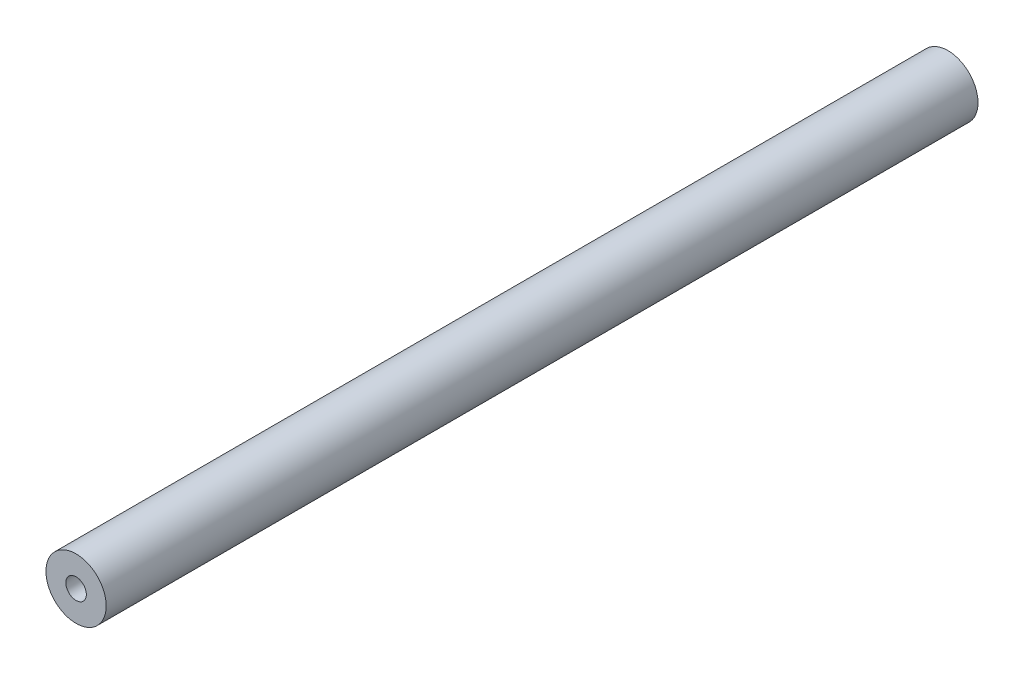
ISO-10303-21;
HEADER;
FILE_DESCRIPTION(('STEP AP214'),'2;1');
FILE_NAME('part.step','',(''),(''),'','','');
FILE_SCHEMA(('AUTOMOTIVE_DESIGN { 1 0 10303 214 1 1 1 1 }'));
ENDSEC;
DATA;
#1=APPLICATION_CONTEXT('core data for automotive mechanical design processes');
#2=APPLICATION_PROTOCOL_DEFINITION('international standard','automotive_design',2000,#1);
#3=PRODUCT_CONTEXT('',#1,'mechanical');
#4=PRODUCT('Part','Part','',(#3));
#5=PRODUCT_RELATED_PRODUCT_CATEGORY('part','',(#4));
#6=PRODUCT_DEFINITION_FORMATION('','',#4);
#7=PRODUCT_DEFINITION_CONTEXT('part definition',#1,'design');
#8=PRODUCT_DEFINITION('design','',#6,#7);
#9=PRODUCT_DEFINITION_SHAPE('','',#8);
#10=(LENGTH_UNIT() NAMED_UNIT(*) SI_UNIT(.MILLI.,.METRE.));
#11=(NAMED_UNIT(*) PLANE_ANGLE_UNIT() SI_UNIT($,.RADIAN.));
#12=(NAMED_UNIT(*) SI_UNIT($,.STERADIAN.) SOLID_ANGLE_UNIT());
#13=UNCERTAINTY_MEASURE_WITH_UNIT(LENGTH_MEASURE(1.E-05),#10,'distance_accuracy_value','');
#14=(GEOMETRIC_REPRESENTATION_CONTEXT(3) GLOBAL_UNCERTAINTY_ASSIGNED_CONTEXT((#13)) GLOBAL_UNIT_ASSIGNED_CONTEXT((#10,
#11,#12)) REPRESENTATION_CONTEXT('',''));
#15=CARTESIAN_POINT('',(0.,0.,0.));
#16=DIRECTION('',(0.,0.,1.));
#17=DIRECTION('',(1.,0.,0.));
#18=AXIS2_PLACEMENT_3D('',#15,#16,#17);
#19=CARTESIAN_POINT('',(0.,0.,217.));
#20=DIRECTION('',(0.,0.,-1.));
#21=DIRECTION('',(-1.,0.,0.));
#22=AXIS2_PLACEMENT_3D('',#19,#20,#21);
#23=CYLINDRICAL_SURFACE('',#22,15.);
#24=CARTESIAN_POINT('',(0.,0.,217.));
#25=DIRECTION('',(0.,0.,1.));
#26=DIRECTION('',(1.,0.,0.));
#27=AXIS2_PLACEMENT_3D('',#24,#25,#26);
#28=CIRCLE('',#27,15.);
#29=CARTESIAN_POINT('',(15.,0.,217.));
#30=VERTEX_POINT('',#29);
#31=EDGE_CURVE('E11',#30,#30,#28,.T.);
#32=ORIENTED_EDGE('',*,*,#31,.F.);
#33=EDGE_LOOP('',(#32));
#34=FACE_BOUND('',#33,.T.);
#35=CARTESIAN_POINT('',(0.,0.,-217.));
#36=DIRECTION('',(0.,0.,1.));
#37=DIRECTION('',(1.,0.,0.));
#38=AXIS2_PLACEMENT_3D('',#35,#36,#37);
#39=CIRCLE('',#38,15.);
#40=CARTESIAN_POINT('',(15.,0.,-217.));
#41=VERTEX_POINT('',#40);
#42=EDGE_CURVE('E43',#41,#41,#39,.T.);
#43=ORIENTED_EDGE('',*,*,#42,.T.);
#44=EDGE_LOOP('',(#43));
#45=FACE_BOUND('',#44,.T.);
#46=ADVANCED_FACE('F40',(#34,#45),#23,.T.);
#47=CARTESIAN_POINT('',(0.,0.,217.));
#48=DIRECTION('',(0.,0.,1.));
#49=DIRECTION('',(1.,0.,0.));
#50=AXIS2_PLACEMENT_3D('',#47,#48,#49);
#51=PLANE('',#50);
#52=CARTESIAN_POINT('',(0.,0.,217.));
#53=DIRECTION('',(0.,0.,1.));
#54=DIRECTION('',(1.,0.,0.));
#55=AXIS2_PLACEMENT_3D('',#52,#53,#54);
#56=CIRCLE('',#55,5.1);
#57=CARTESIAN_POINT('',(5.1,0.,217.));
#58=VERTEX_POINT('',#57);
#59=EDGE_CURVE('E64',#58,#58,#56,.T.);
#60=ORIENTED_EDGE('',*,*,#59,.F.);
#61=EDGE_LOOP('',(#60));
#62=FACE_BOUND('',#61,.T.);
#63=ORIENTED_EDGE('',*,*,#31,.T.);
#64=EDGE_LOOP('',(#63));
#65=FACE_BOUND('',#64,.T.);
#66=ADVANCED_FACE('F82',(#62,#65),#51,.T.);
#67=CARTESIAN_POINT('',(0.,0.,-217.));
#68=DIRECTION('',(0.,0.,1.));
#69=DIRECTION('',(1.,0.,0.));
#70=AXIS2_PLACEMENT_3D('',#67,#68,#69);
#71=PLANE('',#70);
#72=CARTESIAN_POINT('',(0.,0.,-217.));
#73=DIRECTION('',(0.,0.,-1.));
#74=DIRECTION('',(-1.,0.,0.));
#75=AXIS2_PLACEMENT_3D('',#72,#73,#74);
#76=CIRCLE('',#75,5.1);
#77=CARTESIAN_POINT('',(-5.1,0.,-217.));
#78=VERTEX_POINT('',#77);
#79=EDGE_CURVE('E63',#78,#78,#76,.T.);
#80=ORIENTED_EDGE('',*,*,#79,.F.);
#81=EDGE_LOOP('',(#80));
#82=FACE_BOUND('',#81,.T.);
#83=ORIENTED_EDGE('',*,*,#42,.F.);
#84=EDGE_LOOP('',(#83));
#85=FACE_BOUND('',#84,.T.);
#86=ADVANCED_FACE('F79',(#82,#85),#71,.F.);
#87=CARTESIAN_POINT('',(0.,0.,-187.75));
#88=DIRECTION('',(0.,0.,-1.));
#89=DIRECTION('',(-1.,0.,0.));
#90=AXIS2_PLACEMENT_3D('',#87,#88,#89);
#91=CONICAL_SURFACE('',#90,5.09999999999999,1.02974425867665);
#92=CARTESIAN_POINT('',(0.,0.,-184.685610842959));
#93=VERTEX_POINT('',#92);
#94=VERTEX_LOOP('',#93);
#95=FACE_BOUND('',#94,.T.);
#96=CARTESIAN_POINT('',(0.,0.,-187.75));
#97=DIRECTION('',(0.,0.,-1.));
#98=DIRECTION('',(-1.,0.,0.));
#99=AXIS2_PLACEMENT_3D('',#96,#97,#98);
#100=CIRCLE('',#99,5.09999999999999);
#101=CARTESIAN_POINT('',(-5.09999999999999,0.,-187.75));
#102=VERTEX_POINT('',#101);
#103=EDGE_CURVE('E67',#102,#102,#100,.T.);
#104=ORIENTED_EDGE('',*,*,#103,.T.);
#105=EDGE_LOOP('',(#104));
#106=FACE_BOUND('',#105,.T.);
#107=ADVANCED_FACE('F81',(#95,#106),#91,.F.);
#108=CARTESIAN_POINT('',(0.,0.,-217.));
#109=DIRECTION('',(0.,0.,-1.));
#110=DIRECTION('',(-1.,0.,0.));
#111=AXIS2_PLACEMENT_3D('',#108,#109,#110);
#112=CYLINDRICAL_SURFACE('',#111,5.1);
#113=ORIENTED_EDGE('',*,*,#103,.F.);
#114=EDGE_LOOP('',(#113));
#115=FACE_BOUND('',#114,.T.);
#116=ORIENTED_EDGE('',*,*,#79,.T.);
#117=EDGE_LOOP('',(#116));
#118=FACE_BOUND('',#117,.T.);
#119=ADVANCED_FACE('F57',(#115,#118),#112,.F.);
#120=CARTESIAN_POINT('',(0.,0.,187.75));
#121=DIRECTION('',(0.,0.,1.));
#122=DIRECTION('',(1.,0.,0.));
#123=AXIS2_PLACEMENT_3D('',#120,#121,#122);
#124=CONICAL_SURFACE('',#123,5.09999999999999,1.02974425867665);
#125=CARTESIAN_POINT('',(0.,0.,184.685610842959));
#126=VERTEX_POINT('',#125);
#127=VERTEX_LOOP('',#126);
#128=FACE_BOUND('',#127,.T.);
#129=CARTESIAN_POINT('',(0.,0.,187.75));
#130=DIRECTION('',(0.,0.,1.));
#131=DIRECTION('',(1.,0.,0.));
#132=AXIS2_PLACEMENT_3D('',#129,#130,#131);
#133=CIRCLE('',#132,5.09999999999999);
#134=CARTESIAN_POINT('',(5.09999999999999,0.,187.75));
#135=VERTEX_POINT('',#134);
#136=EDGE_CURVE('E61',#135,#135,#133,.T.);
#137=ORIENTED_EDGE('',*,*,#136,.T.);
#138=EDGE_LOOP('',(#137));
#139=FACE_BOUND('',#138,.T.);
#140=ADVANCED_FACE('F53',(#128,#139),#124,.F.);
#141=CARTESIAN_POINT('',(0.,0.,217.));
#142=DIRECTION('',(0.,0.,1.));
#143=DIRECTION('',(1.,0.,0.));
#144=AXIS2_PLACEMENT_3D('',#141,#142,#143);
#145=CYLINDRICAL_SURFACE('',#144,5.1);
#146=ORIENTED_EDGE('',*,*,#136,.F.);
#147=EDGE_LOOP('',(#146));
#148=FACE_BOUND('',#147,.T.);
#149=ORIENTED_EDGE('',*,*,#59,.T.);
#150=EDGE_LOOP('',(#149));
#151=FACE_BOUND('',#150,.T.);
#152=ADVANCED_FACE('F56',(#148,#151),#145,.F.);
#153=CLOSED_SHELL('',(#46,#66,#86,#107,#119,#140,#152));
#154=MANIFOLD_SOLID_BREP('B2',#153);
#155=ADVANCED_BREP_SHAPE_REPRESENTATION('',(#18,#154),#14);
#156=SHAPE_DEFINITION_REPRESENTATION(#9,#155);
ENDSEC;
END-ISO-10303-21;
